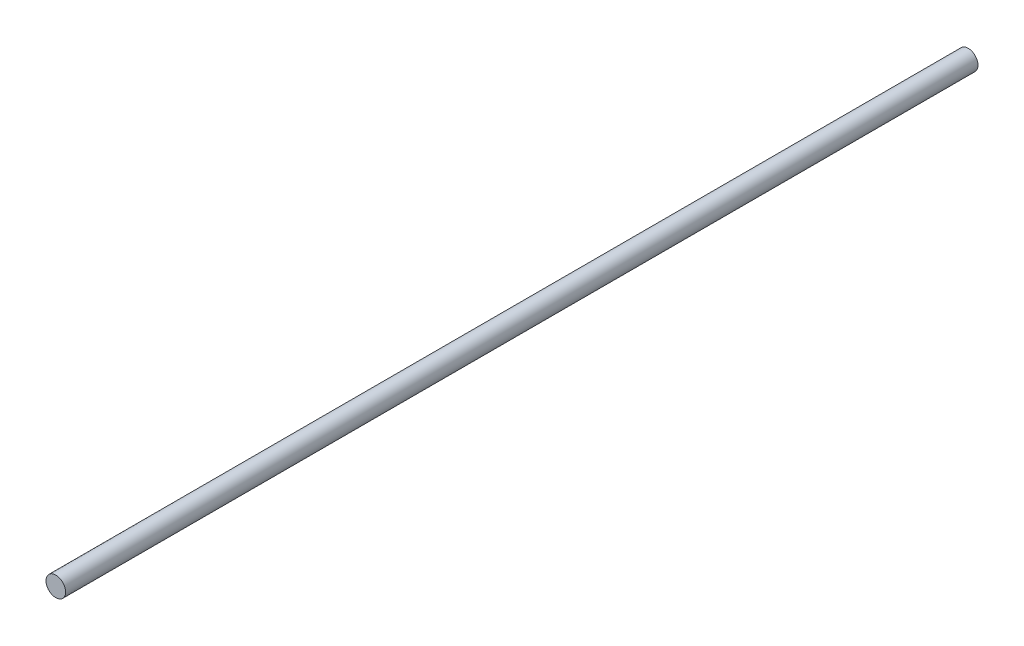
ISO-10303-21;
HEADER;
FILE_DESCRIPTION(('STEP AP214'),'2;1');
FILE_NAME('part.step','',(''),(''),'','','');
FILE_SCHEMA(('AUTOMOTIVE_DESIGN { 1 0 10303 214 1 1 1 1 }'));
ENDSEC;
DATA;
#1=APPLICATION_CONTEXT('core data for automotive mechanical design processes');
#2=APPLICATION_PROTOCOL_DEFINITION('international standard','automotive_design',2000,#1);
#3=PRODUCT_CONTEXT('',#1,'mechanical');
#4=PRODUCT('Part','Part','',(#3));
#5=PRODUCT_RELATED_PRODUCT_CATEGORY('part','',(#4));
#6=PRODUCT_DEFINITION_FORMATION('','',#4);
#7=PRODUCT_DEFINITION_CONTEXT('part definition',#1,'design');
#8=PRODUCT_DEFINITION('design','',#6,#7);
#9=PRODUCT_DEFINITION_SHAPE('','',#8);
#10=(LENGTH_UNIT() NAMED_UNIT(*) SI_UNIT(.MILLI.,.METRE.));
#11=(NAMED_UNIT(*) PLANE_ANGLE_UNIT() SI_UNIT($,.RADIAN.));
#12=(NAMED_UNIT(*) SI_UNIT($,.STERADIAN.) SOLID_ANGLE_UNIT());
#13=UNCERTAINTY_MEASURE_WITH_UNIT(LENGTH_MEASURE(1.E-05),#10,'distance_accuracy_value','');
#14=(GEOMETRIC_REPRESENTATION_CONTEXT(3) GLOBAL_UNCERTAINTY_ASSIGNED_CONTEXT((#13)) GLOBAL_UNIT_ASSIGNED_CONTEXT((#10,
#11,#12)) REPRESENTATION_CONTEXT('',''));
#15=CARTESIAN_POINT('',(0.,0.,0.));
#16=DIRECTION('',(0.,0.,1.));
#17=DIRECTION('',(1.,0.,0.));
#18=AXIS2_PLACEMENT_3D('',#15,#16,#17);
#19=CARTESIAN_POINT('',(0.,0.,372.));
#20=DIRECTION('',(0.,0.,-1.));
#21=DIRECTION('',(-1.,0.,0.));
#22=AXIS2_PLACEMENT_3D('',#19,#20,#21);
#23=CYLINDRICAL_SURFACE('',#22,4.);
#24=CARTESIAN_POINT('',(0.,0.,372.));
#25=DIRECTION('',(0.,0.,1.));
#26=DIRECTION('',(1.,0.,0.));
#27=AXIS2_PLACEMENT_3D('',#24,#25,#26);
#28=CIRCLE('',#27,4.);
#29=CARTESIAN_POINT('',(4.,0.,372.));
#30=VERTEX_POINT('',#29);
#31=EDGE_CURVE('E10',#30,#30,#28,.T.);
#32=ORIENTED_EDGE('',*,*,#31,.F.);
#33=EDGE_LOOP('',(#32));
#34=FACE_BOUND('',#33,.T.);
#35=CARTESIAN_POINT('',(0.,0.,0.));
#36=DIRECTION('',(0.,0.,1.));
#37=DIRECTION('',(1.,0.,0.));
#38=AXIS2_PLACEMENT_3D('',#35,#36,#37);
#39=CIRCLE('',#38,4.);
#40=CARTESIAN_POINT('',(4.,0.,0.));
#41=VERTEX_POINT('',#40);
#42=EDGE_CURVE('E34',#41,#41,#39,.T.);
#43=ORIENTED_EDGE('',*,*,#42,.T.);
#44=EDGE_LOOP('',(#43));
#45=FACE_BOUND('',#44,.T.);
#46=ADVANCED_FACE('F31',(#34,#45),#23,.T.);
#47=CARTESIAN_POINT('',(0.,0.,372.));
#48=DIRECTION('',(0.,0.,1.));
#49=DIRECTION('',(1.,0.,0.));
#50=AXIS2_PLACEMENT_3D('',#47,#48,#49);
#51=PLANE('',#50);
#52=ORIENTED_EDGE('',*,*,#31,.T.);
#53=EDGE_LOOP('',(#52));
#54=FACE_BOUND('',#53,.T.);
#55=ADVANCED_FACE('F46',(#54),#51,.T.);
#56=CARTESIAN_POINT('',(0.,0.,0.));
#57=DIRECTION('',(0.,0.,1.));
#58=DIRECTION('',(1.,0.,0.));
#59=AXIS2_PLACEMENT_3D('',#56,#57,#58);
#60=PLANE('',#59);
#61=ORIENTED_EDGE('',*,*,#42,.F.);
#62=EDGE_LOOP('',(#61));
#63=FACE_BOUND('',#62,.T.);
#64=ADVANCED_FACE('F44',(#63),#60,.F.);
#65=CLOSED_SHELL('',(#46,#55,#64));
#66=MANIFOLD_SOLID_BREP('B2',#65);
#67=ADVANCED_BREP_SHAPE_REPRESENTATION('',(#18,#66),#14);
#68=SHAPE_DEFINITION_REPRESENTATION(#9,#67);
ENDSEC;
END-ISO-10303-21;
